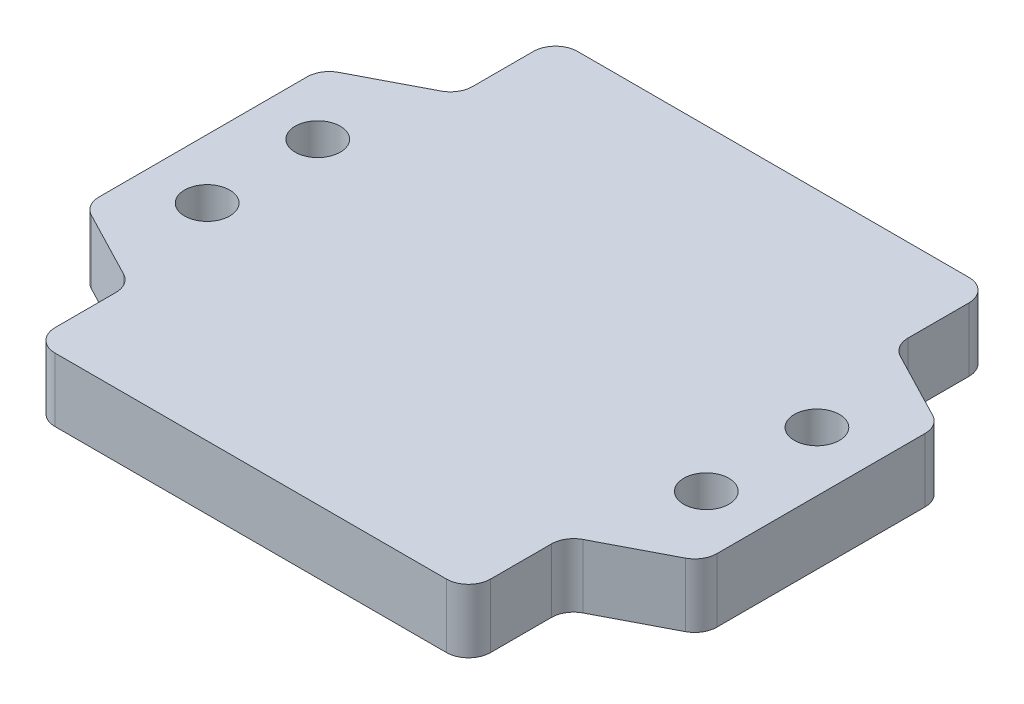
ISO-10303-21;
HEADER;
FILE_DESCRIPTION(('STEP AP214'),'2;1');
FILE_NAME('part.step','',(''),(''),'','','');
FILE_SCHEMA(('AUTOMOTIVE_DESIGN { 1 0 10303 214 1 1 1 1 }'));
ENDSEC;
DATA;
#1=APPLICATION_CONTEXT('core data for automotive mechanical design processes');
#2=APPLICATION_PROTOCOL_DEFINITION('international standard','automotive_design',2000,#1);
#3=PRODUCT_CONTEXT('',#1,'mechanical');
#4=PRODUCT('Part','Part','',(#3));
#5=PRODUCT_RELATED_PRODUCT_CATEGORY('part','',(#4));
#6=PRODUCT_DEFINITION_FORMATION('','',#4);
#7=PRODUCT_DEFINITION_CONTEXT('part definition',#1,'design');
#8=PRODUCT_DEFINITION('design','',#6,#7);
#9=PRODUCT_DEFINITION_SHAPE('','',#8);
#10=(LENGTH_UNIT() NAMED_UNIT(*) SI_UNIT(.MILLI.,.METRE.));
#11=(NAMED_UNIT(*) PLANE_ANGLE_UNIT() SI_UNIT($,.RADIAN.));
#12=(NAMED_UNIT(*) SI_UNIT($,.STERADIAN.) SOLID_ANGLE_UNIT());
#13=UNCERTAINTY_MEASURE_WITH_UNIT(LENGTH_MEASURE(1.E-05),#10,'distance_accuracy_value','');
#14=(GEOMETRIC_REPRESENTATION_CONTEXT(3) GLOBAL_UNCERTAINTY_ASSIGNED_CONTEXT((#13)) GLOBAL_UNIT_ASSIGNED_CONTEXT((#10,
#11,#12)) REPRESENTATION_CONTEXT('',''));
#15=CARTESIAN_POINT('',(0.,0.,0.));
#16=DIRECTION('',(0.,0.,1.));
#17=DIRECTION('',(1.,0.,0.));
#18=AXIS2_PLACEMENT_3D('',#15,#16,#17);
#19=CARTESIAN_POINT('',(0.,7.3152,0.));
#20=DIRECTION('',(0.,1.,0.));
#21=DIRECTION('',(0.,0.,1.));
#22=AXIS2_PLACEMENT_3D('',#19,#20,#21);
#23=PLANE('',#22);
#24=DIRECTION('',(0.,0.,1.));
#25=VECTOR('',#24,1.);
#26=CARTESIAN_POINT('',(-35.472859966,7.3152,30.));
#27=LINE('',#26,#25);
#28=CARTESIAN_POINT('',(-35.472859966,7.3152,-11.9477623690497));
#29=VERTEX_POINT('',#28);
#30=CARTESIAN_POINT('',(-35.472859966,7.3152,11.9477623690497));
#31=VERTEX_POINT('',#30);
#32=EDGE_CURVE('E262',#29,#31,#27,.T.);
#33=ORIENTED_EDGE('',*,*,#32,.T.);
#34=CARTESIAN_POINT('',(-32.932859966,7.3152,11.9477623690497));
#35=DIRECTION('',(0.,1.,0.));
#36=DIRECTION('',(0.,0.,1.));
#37=AXIS2_PLACEMENT_3D('',#34,#35,#36);
#38=CIRCLE('',#37,2.54);
#39=CARTESIAN_POINT('',(-34.1044985055158,7.3152,14.2013956872098));
#40=VERTEX_POINT('',#39);
#41=EDGE_CURVE('E323',#31,#40,#38,.T.);
#42=ORIENTED_EDGE('',*,*,#41,.T.);
#43=DIRECTION('',(0.887257211874052,0.,0.461275015557403));
#44=VECTOR('',#43,1.);
#45=CARTESIAN_POINT('',(-35.472859966,7.3152,13.49));
#46=LINE('',#45,#44);
#47=CARTESIAN_POINT('',(-26.3756204872549,7.3152,18.2195521816319));
#48=VERTEX_POINT('',#47);
#49=EDGE_CURVE('E403',#40,#48,#46,.T.);
#50=ORIENTED_EDGE('',*,*,#49,.T.);
#51=CARTESIAN_POINT('',(-27.5472590267708,7.3152,20.473185499792));
#52=DIRECTION('',(0.,1.,0.));
#53=DIRECTION('',(0.,0.,1.));
#54=AXIS2_PLACEMENT_3D('',#51,#52,#53);
#55=CIRCLE('',#54,2.54);
#56=CARTESIAN_POINT('',(-25.0072590267708,7.3152,20.473185499792));
#57=VERTEX_POINT('',#56);
#58=EDGE_CURVE('E367',#48,#57,#55,.F.);
#59=ORIENTED_EDGE('',*,*,#58,.T.);
#60=DIRECTION('',(0.,0.,1.));
#61=VECTOR('',#60,1.);
#62=CARTESIAN_POINT('',(-25.0072590267708,7.3152,18.9309478688417));
#63=LINE('',#62,#61);
#64=CARTESIAN_POINT('',(-25.0072590267708,7.3152,27.46));
#65=VERTEX_POINT('',#64);
#66=EDGE_CURVE('E400',#57,#65,#63,.T.);
#67=ORIENTED_EDGE('',*,*,#66,.T.);
#68=CARTESIAN_POINT('',(-22.4672590267708,7.3152,27.46));
#69=DIRECTION('',(0.,1.,0.));
#70=DIRECTION('',(0.,0.,1.));
#71=AXIS2_PLACEMENT_3D('',#68,#69,#70);
#72=CIRCLE('',#71,2.54);
#73=CARTESIAN_POINT('',(-22.4672590267707,7.3152,30.));
#74=VERTEX_POINT('',#73);
#75=EDGE_CURVE('E321',#65,#74,#72,.T.);
#76=ORIENTED_EDGE('',*,*,#75,.T.);
#77=DIRECTION('',(1.,0.,0.));
#78=VECTOR('',#77,1.);
#79=CARTESIAN_POINT('',(35.472859966,7.3152,30.));
#80=LINE('',#79,#78);
#81=CARTESIAN_POINT('',(22.4672590267708,7.3152,30.));
#82=VERTEX_POINT('',#81);
#83=EDGE_CURVE('E264',#74,#82,#80,.T.);
#84=ORIENTED_EDGE('',*,*,#83,.T.);
#85=CARTESIAN_POINT('',(22.4672590267708,7.3152,27.46));
#86=DIRECTION('',(0.,1.,0.));
#87=DIRECTION('',(0.,0.,1.));
#88=AXIS2_PLACEMENT_3D('',#85,#86,#87);
#89=CIRCLE('',#88,2.54);
#90=CARTESIAN_POINT('',(25.0072590267708,7.3152,27.46));
#91=VERTEX_POINT('',#90);
#92=EDGE_CURVE('E319',#82,#91,#89,.T.);
#93=ORIENTED_EDGE('',*,*,#92,.T.);
#94=DIRECTION('',(0.,0.,1.));
#95=VECTOR('',#94,1.);
#96=CARTESIAN_POINT('',(25.0072590267708,7.3152,18.9309478688417));
#97=LINE('',#96,#95);
#98=CARTESIAN_POINT('',(25.0072590267708,7.3152,20.473185499792));
#99=VERTEX_POINT('',#98);
#100=EDGE_CURVE('E728',#99,#91,#97,.T.);
#101=ORIENTED_EDGE('',*,*,#100,.F.);
#102=CARTESIAN_POINT('',(27.5472590267708,7.3152,20.473185499792));
#103=DIRECTION('',(0.,1.,0.));
#104=DIRECTION('',(0.,0.,1.));
#105=AXIS2_PLACEMENT_3D('',#102,#103,#104);
#106=CIRCLE('',#105,2.54);
#107=CARTESIAN_POINT('',(26.3756204872549,7.3152,18.2195521816319));
#108=VERTEX_POINT('',#107);
#109=EDGE_CURVE('E371',#99,#108,#106,.F.);
#110=ORIENTED_EDGE('',*,*,#109,.T.);
#111=DIRECTION('',(-0.887257211874052,0.,0.461275015557403));
#112=VECTOR('',#111,1.);
#113=CARTESIAN_POINT('',(35.472859966,7.3152,13.49));
#114=LINE('',#113,#112);
#115=CARTESIAN_POINT('',(34.1044985055158,7.3152,14.2013956872098));
#116=VERTEX_POINT('',#115);
#117=EDGE_CURVE('E720',#116,#108,#114,.T.);
#118=ORIENTED_EDGE('',*,*,#117,.F.);
#119=CARTESIAN_POINT('',(32.932859966,7.3152,11.9477623690497));
#120=DIRECTION('',(0.,1.,0.));
#121=DIRECTION('',(0.,0.,1.));
#122=AXIS2_PLACEMENT_3D('',#119,#120,#121);
#123=CIRCLE('',#122,2.54);
#124=CARTESIAN_POINT('',(35.472859966,7.3152,11.9477623690497));
#125=VERTEX_POINT('',#124);
#126=EDGE_CURVE('E317',#116,#125,#123,.T.);
#127=ORIENTED_EDGE('',*,*,#126,.T.);
#128=DIRECTION('',(0.,0.,-1.));
#129=VECTOR('',#128,1.);
#130=CARTESIAN_POINT('',(35.472859966,7.3152,30.));
#131=LINE('',#130,#129);
#132=CARTESIAN_POINT('',(35.472859966,7.3152,-11.9477623690497));
#133=VERTEX_POINT('',#132);
#134=EDGE_CURVE('E268',#125,#133,#131,.T.);
#135=ORIENTED_EDGE('',*,*,#134,.T.);
#136=CARTESIAN_POINT('',(32.932859966,7.3152,-11.9477623690497));
#137=DIRECTION('',(0.,1.,0.));
#138=DIRECTION('',(0.,0.,1.));
#139=AXIS2_PLACEMENT_3D('',#136,#137,#138);
#140=CIRCLE('',#139,2.54);
#141=CARTESIAN_POINT('',(34.1044985055158,7.3152,-14.2013956872098));
#142=VERTEX_POINT('',#141);
#143=EDGE_CURVE('E315',#133,#142,#140,.T.);
#144=ORIENTED_EDGE('',*,*,#143,.T.);
#145=DIRECTION('',(-0.887257211874052,0.,-0.461275015557403));
#146=VECTOR('',#145,1.);
#147=CARTESIAN_POINT('',(35.472859966,7.3152,-13.49));
#148=LINE('',#147,#146);
#149=CARTESIAN_POINT('',(26.3756204872549,7.3152,-18.2195521816319));
#150=VERTEX_POINT('',#149);
#151=EDGE_CURVE('E379',#142,#150,#148,.T.);
#152=ORIENTED_EDGE('',*,*,#151,.T.);
#153=CARTESIAN_POINT('',(27.5472590267708,7.3152,-20.473185499792));
#154=DIRECTION('',(0.,1.,0.));
#155=DIRECTION('',(0.,0.,1.));
#156=AXIS2_PLACEMENT_3D('',#153,#154,#155);
#157=CIRCLE('',#156,2.54);
#158=CARTESIAN_POINT('',(25.0072590267708,7.3152,-20.473185499792));
#159=VERTEX_POINT('',#158);
#160=EDGE_CURVE('E46',#150,#159,#157,.F.);
#161=ORIENTED_EDGE('',*,*,#160,.T.);
#162=DIRECTION('',(0.,0.,-1.));
#163=VECTOR('',#162,1.);
#164=CARTESIAN_POINT('',(25.0072590267708,7.3152,-18.9309478688417));
#165=LINE('',#164,#163);
#166=CARTESIAN_POINT('',(25.0072590267708,7.3152,-27.46));
#167=VERTEX_POINT('',#166);
#168=EDGE_CURVE('E377',#159,#167,#165,.T.);
#169=ORIENTED_EDGE('',*,*,#168,.T.);
#170=CARTESIAN_POINT('',(22.4672590267708,7.3152,-27.46));
#171=DIRECTION('',(0.,1.,0.));
#172=DIRECTION('',(0.,0.,1.));
#173=AXIS2_PLACEMENT_3D('',#170,#171,#172);
#174=CIRCLE('',#173,2.54);
#175=CARTESIAN_POINT('',(22.4672590267708,7.3152,-30.));
#176=VERTEX_POINT('',#175);
#177=EDGE_CURVE('E313',#167,#176,#174,.T.);
#178=ORIENTED_EDGE('',*,*,#177,.T.);
#179=DIRECTION('',(-1.,0.,0.));
#180=VECTOR('',#179,1.);
#181=CARTESIAN_POINT('',(35.472859966,7.3152,-30.));
#182=LINE('',#181,#180);
#183=CARTESIAN_POINT('',(-22.4672590267707,7.3152,-30.));
#184=VERTEX_POINT('',#183);
#185=EDGE_CURVE('E271',#176,#184,#182,.T.);
#186=ORIENTED_EDGE('',*,*,#185,.T.);
#187=CARTESIAN_POINT('',(-22.4672590267708,7.3152,-27.46));
#188=DIRECTION('',(0.,1.,0.));
#189=DIRECTION('',(0.,0.,1.));
#190=AXIS2_PLACEMENT_3D('',#187,#188,#189);
#191=CIRCLE('',#190,2.54);
#192=CARTESIAN_POINT('',(-25.0072590267708,7.3152,-27.46));
#193=VERTEX_POINT('',#192);
#194=EDGE_CURVE('E210',#184,#193,#191,.T.);
#195=ORIENTED_EDGE('',*,*,#194,.T.);
#196=DIRECTION('',(0.,0.,-1.));
#197=VECTOR('',#196,1.);
#198=CARTESIAN_POINT('',(-25.0072590267708,7.3152,-18.9309478688417));
#199=LINE('',#198,#197);
#200=CARTESIAN_POINT('',(-25.0072590267708,7.3152,-20.473185499792));
#201=VERTEX_POINT('',#200);
#202=EDGE_CURVE('E225',#201,#193,#199,.T.);
#203=ORIENTED_EDGE('',*,*,#202,.F.);
#204=CARTESIAN_POINT('',(-27.5472590267708,7.3152,-20.473185499792));
#205=DIRECTION('',(0.,1.,0.));
#206=DIRECTION('',(0.,0.,1.));
#207=AXIS2_PLACEMENT_3D('',#204,#205,#206);
#208=CIRCLE('',#207,2.54);
#209=CARTESIAN_POINT('',(-26.3756204872549,7.3152,-18.2195521816319));
#210=VERTEX_POINT('',#209);
#211=EDGE_CURVE('E224',#201,#210,#208,.F.);
#212=ORIENTED_EDGE('',*,*,#211,.T.);
#213=DIRECTION('',(0.887257211874052,0.,-0.461275015557403));
#214=VECTOR('',#213,1.);
#215=CARTESIAN_POINT('',(-35.472859966,7.3152,-13.49));
#216=LINE('',#215,#214);
#217=CARTESIAN_POINT('',(-34.1044985055158,7.3152,-14.2013956872098));
#218=VERTEX_POINT('',#217);
#219=EDGE_CURVE('E216',#218,#210,#216,.T.);
#220=ORIENTED_EDGE('',*,*,#219,.F.);
#221=CARTESIAN_POINT('',(-32.932859966,7.3152,-11.9477623690497));
#222=DIRECTION('',(0.,1.,0.));
#223=DIRECTION('',(0.,0.,1.));
#224=AXIS2_PLACEMENT_3D('',#221,#222,#223);
#225=CIRCLE('',#224,2.54);
#226=EDGE_CURVE('E200',#218,#29,#225,.T.);
#227=ORIENTED_EDGE('',*,*,#226,.T.);
#228=EDGE_LOOP('',(#33,#42,#50,#59,#67,#76,#84,#93,#101,#110,#118,#127,#135,#144,#152,#161,#169,
#178,#186,#195,#203,#212,#220,#227));
#229=FACE_BOUND('',#228,.T.);
#230=CARTESIAN_POINT('',(28.662459966,7.3152,6.34740000000001));
#231=DIRECTION('',(0.,1.,0.));
#232=DIRECTION('',(0.,0.,1.));
#233=AXIS2_PLACEMENT_3D('',#230,#231,#232);
#234=CIRCLE('',#233,2.59079999999998);
#235=CARTESIAN_POINT('',(28.662459966,7.3152,8.93819999999999));
#236=VERTEX_POINT('',#235);
#237=EDGE_CURVE('E237',#236,#236,#234,.T.);
#238=ORIENTED_EDGE('',*,*,#237,.F.);
#239=EDGE_LOOP('',(#238));
#240=FACE_BOUND('',#239,.T.);
#241=CARTESIAN_POINT('',(28.662459966,7.3152,-6.35259999999999));
#242=DIRECTION('',(0.,1.,0.));
#243=DIRECTION('',(0.,0.,1.));
#244=AXIS2_PLACEMENT_3D('',#241,#242,#243);
#245=CIRCLE('',#244,2.59079999999998);
#246=CARTESIAN_POINT('',(28.662459966,7.3152,-3.76180000000001));
#247=VERTEX_POINT('',#246);
#248=EDGE_CURVE('E243',#247,#247,#245,.T.);
#249=ORIENTED_EDGE('',*,*,#248,.F.);
#250=EDGE_LOOP('',(#249));
#251=FACE_BOUND('',#250,.T.);
#252=CARTESIAN_POINT('',(-28.662459966,7.3152,6.34740000000001));
#253=DIRECTION('',(0.,1.,0.));
#254=DIRECTION('',(0.,0.,1.));
#255=AXIS2_PLACEMENT_3D('',#252,#253,#254);
#256=CIRCLE('',#255,2.59079999999999);
#257=CARTESIAN_POINT('',(-28.662459966,7.3152,8.93819999999999));
#258=VERTEX_POINT('',#257);
#259=EDGE_CURVE('E249',#258,#258,#256,.T.);
#260=ORIENTED_EDGE('',*,*,#259,.F.);
#261=EDGE_LOOP('',(#260));
#262=FACE_BOUND('',#261,.T.);
#263=CARTESIAN_POINT('',(-28.662459966,7.3152,-6.35259999999999));
#264=DIRECTION('',(0.,1.,0.));
#265=DIRECTION('',(0.,0.,1.));
#266=AXIS2_PLACEMENT_3D('',#263,#264,#265);
#267=CIRCLE('',#266,2.59079999999999);
#268=CARTESIAN_POINT('',(-28.662459966,7.3152,-3.76180000000001));
#269=VERTEX_POINT('',#268);
#270=EDGE_CURVE('E255',#269,#269,#267,.T.);
#271=ORIENTED_EDGE('',*,*,#270,.F.);
#272=EDGE_LOOP('',(#271));
#273=FACE_BOUND('',#272,.T.);
#274=ADVANCED_FACE('F38',(#229,#240,#251,#262,#273),#23,.T.);
#275=CARTESIAN_POINT('',(0.,0.,0.));
#276=DIRECTION('',(0.,1.,0.));
#277=DIRECTION('',(0.,0.,1.));
#278=AXIS2_PLACEMENT_3D('',#275,#276,#277);
#279=PLANE('',#278);
#280=CARTESIAN_POINT('',(28.662459966,0.,6.34740000000001));
#281=DIRECTION('',(0.,1.,0.));
#282=DIRECTION('',(0.,0.,1.));
#283=AXIS2_PLACEMENT_3D('',#280,#281,#282);
#284=CIRCLE('',#283,2.5908);
#285=CARTESIAN_POINT('',(28.662459966,0.,8.9382));
#286=VERTEX_POINT('',#285);
#287=EDGE_CURVE('E240',#286,#286,#284,.T.);
#288=ORIENTED_EDGE('',*,*,#287,.T.);
#289=EDGE_LOOP('',(#288));
#290=FACE_BOUND('',#289,.T.);
#291=CARTESIAN_POINT('',(28.662459966,0.,-6.35259999999999));
#292=DIRECTION('',(0.,1.,0.));
#293=DIRECTION('',(0.,0.,1.));
#294=AXIS2_PLACEMENT_3D('',#291,#292,#293);
#295=CIRCLE('',#294,2.5908);
#296=CARTESIAN_POINT('',(28.662459966,0.,-3.7618));
#297=VERTEX_POINT('',#296);
#298=EDGE_CURVE('E246',#297,#297,#295,.T.);
#299=ORIENTED_EDGE('',*,*,#298,.T.);
#300=EDGE_LOOP('',(#299));
#301=FACE_BOUND('',#300,.T.);
#302=CARTESIAN_POINT('',(-28.662459966,0.,6.34740000000001));
#303=DIRECTION('',(0.,1.,0.));
#304=DIRECTION('',(0.,0.,1.));
#305=AXIS2_PLACEMENT_3D('',#302,#303,#304);
#306=CIRCLE('',#305,2.5908);
#307=CARTESIAN_POINT('',(-28.662459966,0.,8.9382));
#308=VERTEX_POINT('',#307);
#309=EDGE_CURVE('E252',#308,#308,#306,.T.);
#310=ORIENTED_EDGE('',*,*,#309,.T.);
#311=EDGE_LOOP('',(#310));
#312=FACE_BOUND('',#311,.T.);
#313=CARTESIAN_POINT('',(-28.662459966,0.,-6.35259999999999));
#314=DIRECTION('',(0.,1.,0.));
#315=DIRECTION('',(0.,0.,1.));
#316=AXIS2_PLACEMENT_3D('',#313,#314,#315);
#317=CIRCLE('',#316,2.5908);
#318=CARTESIAN_POINT('',(-28.662459966,0.,-3.7618));
#319=VERTEX_POINT('',#318);
#320=EDGE_CURVE('E258',#319,#319,#317,.T.);
#321=ORIENTED_EDGE('',*,*,#320,.T.);
#322=EDGE_LOOP('',(#321));
#323=FACE_BOUND('',#322,.T.);
#324=DIRECTION('',(0.887257211874052,0.,0.461275015557403));
#325=VECTOR('',#324,1.);
#326=CARTESIAN_POINT('',(-35.472859966,0.,13.49));
#327=LINE('',#326,#325);
#328=CARTESIAN_POINT('',(-34.1044985055158,0.,14.2013956872098));
#329=VERTEX_POINT('',#328);
#330=CARTESIAN_POINT('',(-26.3756204872549,0.,18.2195521816319));
#331=VERTEX_POINT('',#330);
#332=EDGE_CURVE('E226',#329,#331,#327,.T.);
#333=ORIENTED_EDGE('',*,*,#332,.F.);
#334=CARTESIAN_POINT('',(-32.932859966,0.,11.9477623690497));
#335=DIRECTION('',(0.,1.,0.));
#336=DIRECTION('',(0.,0.,1.));
#337=AXIS2_PLACEMENT_3D('',#334,#335,#336);
#338=CIRCLE('',#337,2.54);
#339=CARTESIAN_POINT('',(-35.472859966,0.,11.9477623690497));
#340=VERTEX_POINT('',#339);
#341=EDGE_CURVE('E334',#329,#340,#338,.F.);
#342=ORIENTED_EDGE('',*,*,#341,.T.);
#343=DIRECTION('',(0.,0.,1.));
#344=VECTOR('',#343,1.);
#345=CARTESIAN_POINT('',(-35.472859966,0.,30.));
#346=LINE('',#345,#344);
#347=CARTESIAN_POINT('',(-35.472859966,0.,-11.9477623690497));
#348=VERTEX_POINT('',#347);
#349=EDGE_CURVE('E261',#348,#340,#346,.T.);
#350=ORIENTED_EDGE('',*,*,#349,.F.);
#351=CARTESIAN_POINT('',(-32.932859966,0.,-11.9477623690497));
#352=DIRECTION('',(0.,1.,0.));
#353=DIRECTION('',(0.,0.,1.));
#354=AXIS2_PLACEMENT_3D('',#351,#352,#353);
#355=CIRCLE('',#354,2.54);
#356=CARTESIAN_POINT('',(-34.1044985055158,0.,-14.2013956872098));
#357=VERTEX_POINT('',#356);
#358=EDGE_CURVE('E287',#348,#357,#355,.F.);
#359=ORIENTED_EDGE('',*,*,#358,.T.);
#360=DIRECTION('',(0.887257211874052,0.,-0.461275015557403));
#361=VECTOR('',#360,1.);
#362=CARTESIAN_POINT('',(-35.472859966,0.,-13.49));
#363=LINE('',#362,#361);
#364=CARTESIAN_POINT('',(-26.3756204872549,0.,-18.2195521816319));
#365=VERTEX_POINT('',#364);
#366=EDGE_CURVE('E219',#357,#365,#363,.T.);
#367=ORIENTED_EDGE('',*,*,#366,.T.);
#368=CARTESIAN_POINT('',(-27.5472590267708,0.,-20.473185499792));
#369=DIRECTION('',(0.,1.,0.));
#370=DIRECTION('',(0.,0.,1.));
#371=AXIS2_PLACEMENT_3D('',#368,#369,#370);
#372=CIRCLE('',#371,2.54);
#373=CARTESIAN_POINT('',(-25.0072590267708,0.,-20.473185499792));
#374=VERTEX_POINT('',#373);
#375=EDGE_CURVE('E298',#365,#374,#372,.T.);
#376=ORIENTED_EDGE('',*,*,#375,.T.);
#377=DIRECTION('',(0.,0.,-1.));
#378=VECTOR('',#377,1.);
#379=CARTESIAN_POINT('',(-25.0072590267708,0.,-18.9309478688417));
#380=LINE('',#379,#378);
#381=CARTESIAN_POINT('',(-25.0072590267708,0.,-27.46));
#382=VERTEX_POINT('',#381);
#383=EDGE_CURVE('E234',#374,#382,#380,.T.);
#384=ORIENTED_EDGE('',*,*,#383,.T.);
#385=CARTESIAN_POINT('',(-22.4672590267708,0.,-27.46));
#386=DIRECTION('',(0.,1.,0.));
#387=DIRECTION('',(0.,0.,1.));
#388=AXIS2_PLACEMENT_3D('',#385,#386,#387);
#389=CIRCLE('',#388,2.54);
#390=CARTESIAN_POINT('',(-22.4672590267707,0.,-30.));
#391=VERTEX_POINT('',#390);
#392=EDGE_CURVE('E284',#382,#391,#389,.F.);
#393=ORIENTED_EDGE('',*,*,#392,.T.);
#394=DIRECTION('',(-1.,0.,0.));
#395=VECTOR('',#394,1.);
#396=CARTESIAN_POINT('',(35.472859966,0.,-30.));
#397=LINE('',#396,#395);
#398=CARTESIAN_POINT('',(22.4672590267708,0.,-30.));
#399=VERTEX_POINT('',#398);
#400=EDGE_CURVE('E265',#399,#391,#397,.T.);
#401=ORIENTED_EDGE('',*,*,#400,.F.);
#402=CARTESIAN_POINT('',(22.4672590267708,0.,-27.46));
#403=DIRECTION('',(0.,1.,0.));
#404=DIRECTION('',(0.,0.,1.));
#405=AXIS2_PLACEMENT_3D('',#402,#403,#404);
#406=CIRCLE('',#405,2.54);
#407=CARTESIAN_POINT('',(25.0072590267708,0.,-27.46));
#408=VERTEX_POINT('',#407);
#409=EDGE_CURVE('E325',#399,#408,#406,.F.);
#410=ORIENTED_EDGE('',*,*,#409,.T.);
#411=DIRECTION('',(0.,0.,-1.));
#412=VECTOR('',#411,1.);
#413=CARTESIAN_POINT('',(25.0072590267708,0.,-18.9309478688417));
#414=LINE('',#413,#412);
#415=CARTESIAN_POINT('',(25.0072590267708,0.,-20.473185499792));
#416=VERTEX_POINT('',#415);
#417=EDGE_CURVE('E396',#416,#408,#414,.T.);
#418=ORIENTED_EDGE('',*,*,#417,.F.);
#419=CARTESIAN_POINT('',(27.5472590267708,0.,-20.473185499792));
#420=DIRECTION('',(0.,1.,0.));
#421=DIRECTION('',(0.,0.,1.));
#422=AXIS2_PLACEMENT_3D('',#419,#420,#421);
#423=CIRCLE('',#422,2.54);
#424=CARTESIAN_POINT('',(26.3756204872549,0.,-18.2195521816319));
#425=VERTEX_POINT('',#424);
#426=EDGE_CURVE('E11',#416,#425,#423,.T.);
#427=ORIENTED_EDGE('',*,*,#426,.T.);
#428=DIRECTION('',(-0.887257211874052,0.,-0.461275015557403));
#429=VECTOR('',#428,1.);
#430=CARTESIAN_POINT('',(35.472859966,0.,-13.49));
#431=LINE('',#430,#429);
#432=CARTESIAN_POINT('',(34.1044985055158,0.,-14.2013956872098));
#433=VERTEX_POINT('',#432);
#434=EDGE_CURVE('E395',#433,#425,#431,.T.);
#435=ORIENTED_EDGE('',*,*,#434,.F.);
#436=CARTESIAN_POINT('',(32.932859966,0.,-11.9477623690497));
#437=DIRECTION('',(0.,1.,0.));
#438=DIRECTION('',(0.,0.,1.));
#439=AXIS2_PLACEMENT_3D('',#436,#437,#438);
#440=CIRCLE('',#439,2.54);
#441=CARTESIAN_POINT('',(35.472859966,0.,-11.9477623690497));
#442=VERTEX_POINT('',#441);
#443=EDGE_CURVE('E53',#433,#442,#440,.F.);
#444=ORIENTED_EDGE('',*,*,#443,.T.);
#445=DIRECTION('',(0.,0.,-1.));
#446=VECTOR('',#445,1.);
#447=CARTESIAN_POINT('',(35.472859966,0.,30.));
#448=LINE('',#447,#446);
#449=CARTESIAN_POINT('',(35.472859966,0.,11.9477623690497));
#450=VERTEX_POINT('',#449);
#451=EDGE_CURVE('E278',#450,#442,#448,.T.);
#452=ORIENTED_EDGE('',*,*,#451,.F.);
#453=CARTESIAN_POINT('',(32.932859966,0.,11.9477623690497));
#454=DIRECTION('',(0.,1.,0.));
#455=DIRECTION('',(0.,0.,1.));
#456=AXIS2_PLACEMENT_3D('',#453,#454,#455);
#457=CIRCLE('',#456,2.54);
#458=CARTESIAN_POINT('',(34.1044985055158,0.,14.2013956872098));
#459=VERTEX_POINT('',#458);
#460=EDGE_CURVE('E328',#450,#459,#457,.F.);
#461=ORIENTED_EDGE('',*,*,#460,.T.);
#462=DIRECTION('',(-0.887257211874052,0.,0.461275015557403));
#463=VECTOR('',#462,1.);
#464=CARTESIAN_POINT('',(35.472859966,0.,13.49));
#465=LINE('',#464,#463);
#466=CARTESIAN_POINT('',(26.3756204872549,0.,18.2195521816319));
#467=VERTEX_POINT('',#466);
#468=EDGE_CURVE('E726',#459,#467,#465,.T.);
#469=ORIENTED_EDGE('',*,*,#468,.T.);
#470=CARTESIAN_POINT('',(27.5472590267708,0.,20.473185499792));
#471=DIRECTION('',(0.,1.,0.));
#472=DIRECTION('',(0.,0.,1.));
#473=AXIS2_PLACEMENT_3D('',#470,#471,#472);
#474=CIRCLE('',#473,2.54);
#475=CARTESIAN_POINT('',(25.0072590267708,0.,20.473185499792));
#476=VERTEX_POINT('',#475);
#477=EDGE_CURVE('E373',#467,#476,#474,.T.);
#478=ORIENTED_EDGE('',*,*,#477,.T.);
#479=DIRECTION('',(0.,0.,1.));
#480=VECTOR('',#479,1.);
#481=CARTESIAN_POINT('',(25.0072590267708,0.,18.9309478688417));
#482=LINE('',#481,#480);
#483=CARTESIAN_POINT('',(25.0072590267708,0.,27.46));
#484=VERTEX_POINT('',#483);
#485=EDGE_CURVE('E388',#476,#484,#482,.T.);
#486=ORIENTED_EDGE('',*,*,#485,.T.);
#487=CARTESIAN_POINT('',(22.4672590267708,0.,27.46));
#488=DIRECTION('',(0.,1.,0.));
#489=DIRECTION('',(0.,0.,1.));
#490=AXIS2_PLACEMENT_3D('',#487,#488,#489);
#491=CIRCLE('',#490,2.54);
#492=CARTESIAN_POINT('',(22.4672590267708,0.,30.));
#493=VERTEX_POINT('',#492);
#494=EDGE_CURVE('E330',#484,#493,#491,.F.);
#495=ORIENTED_EDGE('',*,*,#494,.T.);
#496=DIRECTION('',(1.,0.,0.));
#497=VECTOR('',#496,1.);
#498=CARTESIAN_POINT('',(35.472859966,0.,30.));
#499=LINE('',#498,#497);
#500=CARTESIAN_POINT('',(-22.4672590267707,0.,30.));
#501=VERTEX_POINT('',#500);
#502=EDGE_CURVE('E275',#501,#493,#499,.T.);
#503=ORIENTED_EDGE('',*,*,#502,.F.);
#504=CARTESIAN_POINT('',(-22.4672590267708,0.,27.46));
#505=DIRECTION('',(0.,1.,0.));
#506=DIRECTION('',(0.,0.,1.));
#507=AXIS2_PLACEMENT_3D('',#504,#505,#506);
#508=CIRCLE('',#507,2.54);
#509=CARTESIAN_POINT('',(-25.0072590267708,0.,27.46));
#510=VERTEX_POINT('',#509);
#511=EDGE_CURVE('E332',#501,#510,#508,.F.);
#512=ORIENTED_EDGE('',*,*,#511,.T.);
#513=DIRECTION('',(0.,0.,1.));
#514=VECTOR('',#513,1.);
#515=CARTESIAN_POINT('',(-25.0072590267708,0.,18.9309478688417));
#516=LINE('',#515,#514);
#517=CARTESIAN_POINT('',(-25.0072590267708,0.,20.473185499792));
#518=VERTEX_POINT('',#517);
#519=EDGE_CURVE('E231',#518,#510,#516,.T.);
#520=ORIENTED_EDGE('',*,*,#519,.F.);
#521=CARTESIAN_POINT('',(-27.5472590267708,0.,20.473185499792));
#522=DIRECTION('',(0.,1.,0.));
#523=DIRECTION('',(0.,0.,1.));
#524=AXIS2_PLACEMENT_3D('',#521,#522,#523);
#525=CIRCLE('',#524,2.54);
#526=EDGE_CURVE('E369',#518,#331,#525,.T.);
#527=ORIENTED_EDGE('',*,*,#526,.T.);
#528=EDGE_LOOP('',(#333,#342,#350,#359,#367,#376,#384,#393,#401,#410,#418,#427,#435,#444,#452,
#461,#469,#478,#486,#495,#503,#512,#520,#527));
#529=FACE_BOUND('',#528,.T.);
#530=ADVANCED_FACE('F394',(#290,#301,#312,#323,#529),#279,.F.);
#531=CARTESIAN_POINT('',(35.472859966,7.3152,30.));
#532=DIRECTION('',(-1.,0.,0.));
#533=DIRECTION('',(0.,0.,1.));
#534=AXIS2_PLACEMENT_3D('',#531,#532,#533);
#535=PLANE('',#534);
#536=ORIENTED_EDGE('',*,*,#134,.F.);
#537=DIRECTION('',(0.,1.,0.));
#538=VECTOR('',#537,1.);
#539=CARTESIAN_POINT('',(35.472859966,7.3152,11.9477623690497));
#540=LINE('',#539,#538);
#541=EDGE_CURVE('E60',#125,#450,#540,.F.);
#542=ORIENTED_EDGE('',*,*,#541,.T.);
#543=ORIENTED_EDGE('',*,*,#451,.T.);
#544=DIRECTION('',(0.,1.,0.));
#545=VECTOR('',#544,1.);
#546=CARTESIAN_POINT('',(35.472859966,7.3152,-11.9477623690497));
#547=LINE('',#546,#545);
#548=EDGE_CURVE('E351',#442,#133,#547,.T.);
#549=ORIENTED_EDGE('',*,*,#548,.T.);
#550=EDGE_LOOP('',(#536,#542,#543,#549));
#551=FACE_BOUND('',#550,.T.);
#552=ADVANCED_FACE('F450',(#551),#535,.F.);
#553=CARTESIAN_POINT('',(35.472859966,7.3152,-30.));
#554=DIRECTION('',(0.,0.,1.));
#555=DIRECTION('',(1.,0.,0.));
#556=AXIS2_PLACEMENT_3D('',#553,#554,#555);
#557=PLANE('',#556);
#558=ORIENTED_EDGE('',*,*,#185,.F.);
#559=DIRECTION('',(0.,1.,0.));
#560=VECTOR('',#559,1.);
#561=CARTESIAN_POINT('',(22.4672590267708,0.,-30.));
#562=LINE('',#561,#560);
#563=EDGE_CURVE('E365',#176,#399,#562,.F.);
#564=ORIENTED_EDGE('',*,*,#563,.T.);
#565=ORIENTED_EDGE('',*,*,#400,.T.);
#566=DIRECTION('',(0.,1.,0.));
#567=VECTOR('',#566,1.);
#568=CARTESIAN_POINT('',(-22.4672590267708,7.3152,-30.));
#569=LINE('',#568,#567);
#570=EDGE_CURVE('E289',#391,#184,#569,.T.);
#571=ORIENTED_EDGE('',*,*,#570,.T.);
#572=EDGE_LOOP('',(#558,#564,#565,#571));
#573=FACE_BOUND('',#572,.T.);
#574=ADVANCED_FACE('F426',(#573),#557,.F.);
#575=CARTESIAN_POINT('',(-35.472859966,7.3152,30.));
#576=DIRECTION('',(1.,0.,0.));
#577=DIRECTION('',(0.,0.,-1.));
#578=AXIS2_PLACEMENT_3D('',#575,#576,#577);
#579=PLANE('',#578);
#580=ORIENTED_EDGE('',*,*,#349,.T.);
#581=DIRECTION('',(0.,1.,0.));
#582=VECTOR('',#581,1.);
#583=CARTESIAN_POINT('',(-35.472859966,7.3152,11.9477623690497));
#584=LINE('',#583,#582);
#585=EDGE_CURVE('E310',#340,#31,#584,.T.);
#586=ORIENTED_EDGE('',*,*,#585,.T.);
#587=ORIENTED_EDGE('',*,*,#32,.F.);
#588=DIRECTION('',(0.,1.,0.));
#589=VECTOR('',#588,1.);
#590=CARTESIAN_POINT('',(-35.472859966,7.3152,-11.9477623690497));
#591=LINE('',#590,#589);
#592=EDGE_CURVE('E205',#29,#348,#591,.F.);
#593=ORIENTED_EDGE('',*,*,#592,.T.);
#594=EDGE_LOOP('',(#580,#586,#587,#593));
#595=FACE_BOUND('',#594,.T.);
#596=ADVANCED_FACE('F459',(#595),#579,.F.);
#597=CARTESIAN_POINT('',(35.472859966,7.3152,30.));
#598=DIRECTION('',(0.,0.,-1.));
#599=DIRECTION('',(-1.,0.,0.));
#600=AXIS2_PLACEMENT_3D('',#597,#598,#599);
#601=PLANE('',#600);
#602=ORIENTED_EDGE('',*,*,#83,.F.);
#603=DIRECTION('',(0.,1.,0.));
#604=VECTOR('',#603,1.);
#605=CARTESIAN_POINT('',(-22.4672590267708,0.,30.));
#606=LINE('',#605,#604);
#607=EDGE_CURVE('E339',#74,#501,#606,.F.);
#608=ORIENTED_EDGE('',*,*,#607,.T.);
#609=ORIENTED_EDGE('',*,*,#502,.T.);
#610=DIRECTION('',(0.,1.,0.));
#611=VECTOR('',#610,1.);
#612=CARTESIAN_POINT('',(22.4672590267708,7.3152,30.));
#613=LINE('',#612,#611);
#614=EDGE_CURVE('E336',#493,#82,#613,.T.);
#615=ORIENTED_EDGE('',*,*,#614,.T.);
#616=EDGE_LOOP('',(#602,#608,#609,#615));
#617=FACE_BOUND('',#616,.T.);
#618=ADVANCED_FACE('F462',(#617),#601,.F.);
#619=CARTESIAN_POINT('',(-28.662459966,7.3152,-6.35259999999999));
#620=DIRECTION('',(0.,1.,0.));
#621=DIRECTION('',(0.,0.,1.));
#622=AXIS2_PLACEMENT_3D('',#619,#620,#621);
#623=CYLINDRICAL_SURFACE('',#622,2.59079999999999);
#624=ORIENTED_EDGE('',*,*,#320,.F.);
#625=EDGE_LOOP('',(#624));
#626=FACE_BOUND('',#625,.T.);
#627=ORIENTED_EDGE('',*,*,#270,.T.);
#628=EDGE_LOOP('',(#627));
#629=FACE_BOUND('',#628,.T.);
#630=ADVANCED_FACE('F454',(#626,#629),#623,.F.);
#631=CARTESIAN_POINT('',(-28.662459966,7.3152,6.34740000000001));
#632=DIRECTION('',(0.,1.,0.));
#633=DIRECTION('',(0.,0.,1.));
#634=AXIS2_PLACEMENT_3D('',#631,#632,#633);
#635=CYLINDRICAL_SURFACE('',#634,2.59079999999999);
#636=ORIENTED_EDGE('',*,*,#309,.F.);
#637=EDGE_LOOP('',(#636));
#638=FACE_BOUND('',#637,.T.);
#639=ORIENTED_EDGE('',*,*,#259,.T.);
#640=EDGE_LOOP('',(#639));
#641=FACE_BOUND('',#640,.T.);
#642=ADVANCED_FACE('F486',(#638,#641),#635,.F.);
#643=CARTESIAN_POINT('',(28.662459966,7.3152,-6.35259999999999));
#644=DIRECTION('',(0.,1.,0.));
#645=DIRECTION('',(0.,0.,1.));
#646=AXIS2_PLACEMENT_3D('',#643,#644,#645);
#647=CYLINDRICAL_SURFACE('',#646,2.59079999999999);
#648=ORIENTED_EDGE('',*,*,#298,.F.);
#649=EDGE_LOOP('',(#648));
#650=FACE_BOUND('',#649,.T.);
#651=ORIENTED_EDGE('',*,*,#248,.T.);
#652=EDGE_LOOP('',(#651));
#653=FACE_BOUND('',#652,.T.);
#654=ADVANCED_FACE('F483',(#650,#653),#647,.F.);
#655=CARTESIAN_POINT('',(28.662459966,7.3152,6.34740000000001));
#656=DIRECTION('',(0.,1.,0.));
#657=DIRECTION('',(0.,0.,1.));
#658=AXIS2_PLACEMENT_3D('',#655,#656,#657);
#659=CYLINDRICAL_SURFACE('',#658,2.59079999999999);
#660=ORIENTED_EDGE('',*,*,#287,.F.);
#661=EDGE_LOOP('',(#660));
#662=FACE_BOUND('',#661,.T.);
#663=ORIENTED_EDGE('',*,*,#237,.T.);
#664=EDGE_LOOP('',(#663));
#665=FACE_BOUND('',#664,.T.);
#666=ADVANCED_FACE('F477',(#662,#665),#659,.F.);
#667=CARTESIAN_POINT('',(-25.0072590267708,0.,-18.9309478688417));
#668=DIRECTION('',(1.,0.,0.));
#669=DIRECTION('',(0.,0.,-1.));
#670=AXIS2_PLACEMENT_3D('',#667,#668,#669);
#671=PLANE('',#670);
#672=ORIENTED_EDGE('',*,*,#202,.T.);
#673=DIRECTION('',(0.,1.,0.));
#674=VECTOR('',#673,1.);
#675=CARTESIAN_POINT('',(-25.0072590267708,0.,-27.46));
#676=LINE('',#675,#674);
#677=EDGE_CURVE('E295',#193,#382,#676,.F.);
#678=ORIENTED_EDGE('',*,*,#677,.T.);
#679=ORIENTED_EDGE('',*,*,#383,.F.);
#680=DIRECTION('',(0.,1.,0.));
#681=VECTOR('',#680,1.);
#682=CARTESIAN_POINT('',(-25.0072590267708,7.3152,-20.473185499792));
#683=LINE('',#682,#681);
#684=EDGE_CURVE('E292',#374,#201,#683,.T.);
#685=ORIENTED_EDGE('',*,*,#684,.T.);
#686=EDGE_LOOP('',(#672,#678,#679,#685));
#687=FACE_BOUND('',#686,.T.);
#688=ADVANCED_FACE('F430',(#687),#671,.F.);
#689=CARTESIAN_POINT('',(-35.472859966,0.,-13.49));
#690=DIRECTION('',(0.461275015557403,0.,0.887257211874052));
#691=DIRECTION('',(0.887257211874052,0.,-0.461275015557403));
#692=AXIS2_PLACEMENT_3D('',#689,#690,#691);
#693=PLANE('',#692);
#694=ORIENTED_EDGE('',*,*,#366,.F.);
#695=DIRECTION('',(0.,1.,0.));
#696=VECTOR('',#695,1.);
#697=CARTESIAN_POINT('',(-34.1044985055158,0.,-14.2013956872098));
#698=LINE('',#697,#696);
#699=EDGE_CURVE('E204',#357,#218,#698,.T.);
#700=ORIENTED_EDGE('',*,*,#699,.T.);
#701=ORIENTED_EDGE('',*,*,#219,.T.);
#702=DIRECTION('',(0.,1.,0.));
#703=VECTOR('',#702,1.);
#704=CARTESIAN_POINT('',(-26.3756204872549,0.,-18.2195521816319));
#705=LINE('',#704,#703);
#706=EDGE_CURVE('E220',#210,#365,#705,.F.);
#707=ORIENTED_EDGE('',*,*,#706,.T.);
#708=EDGE_LOOP('',(#694,#700,#701,#707));
#709=FACE_BOUND('',#708,.T.);
#710=ADVANCED_FACE('F215',(#709),#693,.F.);
#711=CARTESIAN_POINT('',(-32.932859966,0.,-11.9477623690497));
#712=DIRECTION('',(0.,1.,0.));
#713=DIRECTION('',(0.,0.,1.));
#714=AXIS2_PLACEMENT_3D('',#711,#712,#713);
#715=CYLINDRICAL_SURFACE('',#714,2.54);
#716=ORIENTED_EDGE('',*,*,#358,.F.);
#717=ORIENTED_EDGE('',*,*,#592,.F.);
#718=ORIENTED_EDGE('',*,*,#226,.F.);
#719=ORIENTED_EDGE('',*,*,#699,.F.);
#720=EDGE_LOOP('',(#716,#717,#718,#719));
#721=FACE_BOUND('',#720,.T.);
#722=ADVANCED_FACE('F203',(#721),#715,.T.);
#723=CARTESIAN_POINT('',(-22.4672590267708,7.3152,-27.46));
#724=DIRECTION('',(0.,1.,0.));
#725=DIRECTION('',(0.,0.,1.));
#726=AXIS2_PLACEMENT_3D('',#723,#724,#725);
#727=CYLINDRICAL_SURFACE('',#726,2.54);
#728=ORIENTED_EDGE('',*,*,#392,.F.);
#729=ORIENTED_EDGE('',*,*,#677,.F.);
#730=ORIENTED_EDGE('',*,*,#194,.F.);
#731=ORIENTED_EDGE('',*,*,#570,.F.);
#732=EDGE_LOOP('',(#728,#729,#730,#731));
#733=FACE_BOUND('',#732,.T.);
#734=ADVANCED_FACE('F422',(#733),#727,.T.);
#735=CARTESIAN_POINT('',(-27.5472590267708,0.,-20.473185499792));
#736=DIRECTION('',(0.,-1.,0.));
#737=DIRECTION('',(0.,0.,-1.));
#738=AXIS2_PLACEMENT_3D('',#735,#736,#737);
#739=CYLINDRICAL_SURFACE('',#738,2.54);
#740=ORIENTED_EDGE('',*,*,#375,.F.);
#741=ORIENTED_EDGE('',*,*,#706,.F.);
#742=ORIENTED_EDGE('',*,*,#211,.F.);
#743=ORIENTED_EDGE('',*,*,#684,.F.);
#744=EDGE_LOOP('',(#740,#741,#742,#743));
#745=FACE_BOUND('',#744,.T.);
#746=ADVANCED_FACE('F432',(#745),#739,.F.);
#747=CARTESIAN_POINT('',(-35.472859966,0.,13.49));
#748=DIRECTION('',(-0.461275015557403,0.,0.887257211874052));
#749=DIRECTION('',(0.887257211874052,0.,0.461275015557403));
#750=AXIS2_PLACEMENT_3D('',#747,#748,#749);
#751=PLANE('',#750);
#752=ORIENTED_EDGE('',*,*,#332,.T.);
#753=DIRECTION('',(0.,1.,0.));
#754=VECTOR('',#753,1.);
#755=CARTESIAN_POINT('',(-26.3756204872549,7.3152,18.2195521816319));
#756=LINE('',#755,#754);
#757=EDGE_CURVE('E302',#331,#48,#756,.T.);
#758=ORIENTED_EDGE('',*,*,#757,.T.);
#759=ORIENTED_EDGE('',*,*,#49,.F.);
#760=DIRECTION('',(0.,1.,0.));
#761=VECTOR('',#760,1.);
#762=CARTESIAN_POINT('',(-34.1044985055158,0.,14.2013956872098));
#763=LINE('',#762,#761);
#764=EDGE_CURVE('E300',#40,#329,#763,.F.);
#765=ORIENTED_EDGE('',*,*,#764,.T.);
#766=EDGE_LOOP('',(#752,#758,#759,#765));
#767=FACE_BOUND('',#766,.T.);
#768=ADVANCED_FACE('F434',(#767),#751,.T.);
#769=CARTESIAN_POINT('',(-25.0072590267708,0.,18.9309478688417));
#770=DIRECTION('',(-1.,0.,0.));
#771=DIRECTION('',(0.,0.,1.));
#772=AXIS2_PLACEMENT_3D('',#769,#770,#771);
#773=PLANE('',#772);
#774=ORIENTED_EDGE('',*,*,#66,.F.);
#775=DIRECTION('',(0.,1.,0.));
#776=VECTOR('',#775,1.);
#777=CARTESIAN_POINT('',(-25.0072590267708,0.,20.473185499792));
#778=LINE('',#777,#776);
#779=EDGE_CURVE('E308',#57,#518,#778,.F.);
#780=ORIENTED_EDGE('',*,*,#779,.T.);
#781=ORIENTED_EDGE('',*,*,#519,.T.);
#782=DIRECTION('',(0.,1.,0.));
#783=VECTOR('',#782,1.);
#784=CARTESIAN_POINT('',(-25.0072590267708,7.3152,27.46));
#785=LINE('',#784,#783);
#786=EDGE_CURVE('E305',#510,#65,#785,.T.);
#787=ORIENTED_EDGE('',*,*,#786,.T.);
#788=EDGE_LOOP('',(#774,#780,#781,#787));
#789=FACE_BOUND('',#788,.T.);
#790=ADVANCED_FACE('F440',(#789),#773,.T.);
#791=CARTESIAN_POINT('',(35.472859966,0.,-13.49));
#792=DIRECTION('',(0.461275015557403,0.,-0.887257211874052));
#793=DIRECTION('',(-0.887257211874052,0.,-0.461275015557403));
#794=AXIS2_PLACEMENT_3D('',#791,#792,#793);
#795=PLANE('',#794);
#796=ORIENTED_EDGE('',*,*,#434,.T.);
#797=DIRECTION('',(0.,1.,0.));
#798=VECTOR('',#797,1.);
#799=CARTESIAN_POINT('',(26.3756204872549,7.3152,-18.2195521816319));
#800=LINE('',#799,#798);
#801=EDGE_CURVE('E357',#425,#150,#800,.T.);
#802=ORIENTED_EDGE('',*,*,#801,.T.);
#803=ORIENTED_EDGE('',*,*,#151,.F.);
#804=DIRECTION('',(0.,1.,0.));
#805=VECTOR('',#804,1.);
#806=CARTESIAN_POINT('',(34.1044985055158,0.,-14.2013956872098));
#807=LINE('',#806,#805);
#808=EDGE_CURVE('E355',#142,#433,#807,.F.);
#809=ORIENTED_EDGE('',*,*,#808,.T.);
#810=EDGE_LOOP('',(#796,#802,#803,#809));
#811=FACE_BOUND('',#810,.T.);
#812=ADVANCED_FACE('F398',(#811),#795,.T.);
#813=CARTESIAN_POINT('',(25.0072590267708,0.,-18.9309478688417));
#814=DIRECTION('',(1.,0.,0.));
#815=DIRECTION('',(0.,0.,-1.));
#816=AXIS2_PLACEMENT_3D('',#813,#814,#815);
#817=PLANE('',#816);
#818=ORIENTED_EDGE('',*,*,#168,.F.);
#819=DIRECTION('',(0.,1.,0.));
#820=VECTOR('',#819,1.);
#821=CARTESIAN_POINT('',(25.0072590267708,0.,-20.473185499792));
#822=LINE('',#821,#820);
#823=EDGE_CURVE('E363',#159,#416,#822,.F.);
#824=ORIENTED_EDGE('',*,*,#823,.T.);
#825=ORIENTED_EDGE('',*,*,#417,.T.);
#826=DIRECTION('',(0.,1.,0.));
#827=VECTOR('',#826,1.);
#828=CARTESIAN_POINT('',(25.0072590267708,7.3152,-27.46));
#829=LINE('',#828,#827);
#830=EDGE_CURVE('E360',#408,#167,#829,.T.);
#831=ORIENTED_EDGE('',*,*,#830,.T.);
#832=EDGE_LOOP('',(#818,#824,#825,#831));
#833=FACE_BOUND('',#832,.T.);
#834=ADVANCED_FACE('F384',(#833),#817,.T.);
#835=CARTESIAN_POINT('',(25.0072590267708,0.,18.9309478688417));
#836=DIRECTION('',(-1.,0.,0.));
#837=DIRECTION('',(0.,0.,1.));
#838=AXIS2_PLACEMENT_3D('',#835,#836,#837);
#839=PLANE('',#838);
#840=ORIENTED_EDGE('',*,*,#100,.T.);
#841=DIRECTION('',(0.,1.,0.));
#842=VECTOR('',#841,1.);
#843=CARTESIAN_POINT('',(25.0072590267708,0.,27.46));
#844=LINE('',#843,#842);
#845=EDGE_CURVE('E344',#91,#484,#844,.F.);
#846=ORIENTED_EDGE('',*,*,#845,.T.);
#847=ORIENTED_EDGE('',*,*,#485,.F.);
#848=DIRECTION('',(0.,1.,0.));
#849=VECTOR('',#848,1.);
#850=CARTESIAN_POINT('',(25.0072590267708,7.3152,20.473185499792));
#851=LINE('',#850,#849);
#852=EDGE_CURVE('E341',#476,#99,#851,.T.);
#853=ORIENTED_EDGE('',*,*,#852,.T.);
#854=EDGE_LOOP('',(#840,#846,#847,#853));
#855=FACE_BOUND('',#854,.T.);
#856=ADVANCED_FACE('F609',(#855),#839,.F.);
#857=CARTESIAN_POINT('',(35.472859966,0.,13.49));
#858=DIRECTION('',(-0.461275015557403,0.,-0.887257211874052));
#859=DIRECTION('',(-0.887257211874052,0.,0.461275015557403));
#860=AXIS2_PLACEMENT_3D('',#857,#858,#859);
#861=PLANE('',#860);
#862=ORIENTED_EDGE('',*,*,#117,.T.);
#863=DIRECTION('',(0.,1.,0.));
#864=VECTOR('',#863,1.);
#865=CARTESIAN_POINT('',(26.3756204872549,0.,18.2195521816319));
#866=LINE('',#865,#864);
#867=EDGE_CURVE('E349',#108,#467,#866,.F.);
#868=ORIENTED_EDGE('',*,*,#867,.T.);
#869=ORIENTED_EDGE('',*,*,#468,.F.);
#870=DIRECTION('',(0.,1.,0.));
#871=VECTOR('',#870,1.);
#872=CARTESIAN_POINT('',(34.1044985055158,0.,14.2013956872098));
#873=LINE('',#872,#871);
#874=EDGE_CURVE('E346',#459,#116,#873,.T.);
#875=ORIENTED_EDGE('',*,*,#874,.T.);
#876=EDGE_LOOP('',(#862,#868,#869,#875));
#877=FACE_BOUND('',#876,.T.);
#878=ADVANCED_FACE('F617',(#877),#861,.F.);
#879=CARTESIAN_POINT('',(-27.5472590267708,0.,20.473185499792));
#880=DIRECTION('',(0.,-1.,0.));
#881=DIRECTION('',(0.,0.,-1.));
#882=AXIS2_PLACEMENT_3D('',#879,#880,#881);
#883=CYLINDRICAL_SURFACE('',#882,2.54);
#884=ORIENTED_EDGE('',*,*,#526,.F.);
#885=ORIENTED_EDGE('',*,*,#779,.F.);
#886=ORIENTED_EDGE('',*,*,#58,.F.);
#887=ORIENTED_EDGE('',*,*,#757,.F.);
#888=EDGE_LOOP('',(#884,#885,#886,#887));
#889=FACE_BOUND('',#888,.T.);
#890=ADVANCED_FACE('F626',(#889),#883,.F.);
#891=CARTESIAN_POINT('',(-32.932859966,7.3152,11.9477623690497));
#892=DIRECTION('',(0.,-1.,0.));
#893=DIRECTION('',(0.,0.,-1.));
#894=AXIS2_PLACEMENT_3D('',#891,#892,#893);
#895=CYLINDRICAL_SURFACE('',#894,2.54);
#896=ORIENTED_EDGE('',*,*,#341,.F.);
#897=ORIENTED_EDGE('',*,*,#764,.F.);
#898=ORIENTED_EDGE('',*,*,#41,.F.);
#899=ORIENTED_EDGE('',*,*,#585,.F.);
#900=EDGE_LOOP('',(#896,#897,#898,#899));
#901=FACE_BOUND('',#900,.T.);
#902=ADVANCED_FACE('F635',(#901),#895,.T.);
#903=CARTESIAN_POINT('',(-22.4672590267708,0.,27.46));
#904=DIRECTION('',(0.,-1.,0.));
#905=DIRECTION('',(0.,0.,-1.));
#906=AXIS2_PLACEMENT_3D('',#903,#904,#905);
#907=CYLINDRICAL_SURFACE('',#906,2.54);
#908=ORIENTED_EDGE('',*,*,#511,.F.);
#909=ORIENTED_EDGE('',*,*,#607,.F.);
#910=ORIENTED_EDGE('',*,*,#75,.F.);
#911=ORIENTED_EDGE('',*,*,#786,.F.);
#912=EDGE_LOOP('',(#908,#909,#910,#911));
#913=FACE_BOUND('',#912,.T.);
#914=ADVANCED_FACE('F643',(#913),#907,.T.);
#915=CARTESIAN_POINT('',(22.4672590267708,7.3152,27.46));
#916=DIRECTION('',(0.,1.,0.));
#917=DIRECTION('',(0.,0.,1.));
#918=AXIS2_PLACEMENT_3D('',#915,#916,#917);
#919=CYLINDRICAL_SURFACE('',#918,2.54);
#920=ORIENTED_EDGE('',*,*,#494,.F.);
#921=ORIENTED_EDGE('',*,*,#845,.F.);
#922=ORIENTED_EDGE('',*,*,#92,.F.);
#923=ORIENTED_EDGE('',*,*,#614,.F.);
#924=EDGE_LOOP('',(#920,#921,#922,#923));
#925=FACE_BOUND('',#924,.T.);
#926=ADVANCED_FACE('F652',(#925),#919,.T.);
#927=CARTESIAN_POINT('',(27.5472590267708,0.,20.473185499792));
#928=DIRECTION('',(0.,-1.,0.));
#929=DIRECTION('',(0.,0.,-1.));
#930=AXIS2_PLACEMENT_3D('',#927,#928,#929);
#931=CYLINDRICAL_SURFACE('',#930,2.54);
#932=ORIENTED_EDGE('',*,*,#477,.F.);
#933=ORIENTED_EDGE('',*,*,#867,.F.);
#934=ORIENTED_EDGE('',*,*,#109,.F.);
#935=ORIENTED_EDGE('',*,*,#852,.F.);
#936=EDGE_LOOP('',(#932,#933,#934,#935));
#937=FACE_BOUND('',#936,.T.);
#938=ADVANCED_FACE('F661',(#937),#931,.F.);
#939=CARTESIAN_POINT('',(32.932859966,0.,11.9477623690497));
#940=DIRECTION('',(0.,1.,0.));
#941=DIRECTION('',(0.,0.,1.));
#942=AXIS2_PLACEMENT_3D('',#939,#940,#941);
#943=CYLINDRICAL_SURFACE('',#942,2.54);
#944=ORIENTED_EDGE('',*,*,#460,.F.);
#945=ORIENTED_EDGE('',*,*,#541,.F.);
#946=ORIENTED_EDGE('',*,*,#126,.F.);
#947=ORIENTED_EDGE('',*,*,#874,.F.);
#948=EDGE_LOOP('',(#944,#945,#946,#947));
#949=FACE_BOUND('',#948,.T.);
#950=ADVANCED_FACE('F670',(#949),#943,.T.);
#951=CARTESIAN_POINT('',(27.5472590267708,0.,-20.473185499792));
#952=DIRECTION('',(0.,-1.,0.));
#953=DIRECTION('',(0.,0.,-1.));
#954=AXIS2_PLACEMENT_3D('',#951,#952,#953);
#955=CYLINDRICAL_SURFACE('',#954,2.54);
#956=ORIENTED_EDGE('',*,*,#426,.F.);
#957=ORIENTED_EDGE('',*,*,#823,.F.);
#958=ORIENTED_EDGE('',*,*,#160,.F.);
#959=ORIENTED_EDGE('',*,*,#801,.F.);
#960=EDGE_LOOP('',(#956,#957,#958,#959));
#961=FACE_BOUND('',#960,.T.);
#962=ADVANCED_FACE('F391',(#961),#955,.F.);
#963=CARTESIAN_POINT('',(32.932859966,7.3152,-11.9477623690497));
#964=DIRECTION('',(0.,-1.,0.));
#965=DIRECTION('',(0.,0.,-1.));
#966=AXIS2_PLACEMENT_3D('',#963,#964,#965);
#967=CYLINDRICAL_SURFACE('',#966,2.54);
#968=ORIENTED_EDGE('',*,*,#443,.F.);
#969=ORIENTED_EDGE('',*,*,#808,.F.);
#970=ORIENTED_EDGE('',*,*,#143,.F.);
#971=ORIENTED_EDGE('',*,*,#548,.F.);
#972=EDGE_LOOP('',(#968,#969,#970,#971));
#973=FACE_BOUND('',#972,.T.);
#974=ADVANCED_FACE('F687',(#973),#967,.T.);
#975=CARTESIAN_POINT('',(22.4672590267708,0.,-27.46));
#976=DIRECTION('',(0.,-1.,0.));
#977=DIRECTION('',(0.,0.,-1.));
#978=AXIS2_PLACEMENT_3D('',#975,#976,#977);
#979=CYLINDRICAL_SURFACE('',#978,2.54);
#980=ORIENTED_EDGE('',*,*,#409,.F.);
#981=ORIENTED_EDGE('',*,*,#563,.F.);
#982=ORIENTED_EDGE('',*,*,#177,.F.);
#983=ORIENTED_EDGE('',*,*,#830,.F.);
#984=EDGE_LOOP('',(#980,#981,#982,#983));
#985=FACE_BOUND('',#984,.T.);
#986=ADVANCED_FACE('F40',(#985),#979,.T.);
#987=CLOSED_SHELL('',(#274,#530,#552,#574,#596,#618,#630,#642,#654,#666,#688,#710,#722,#734,
#746,#768,#790,#812,#834,#856,#878,#890,#902,#914,#926,#938,#950,#962,#974,#986));
#988=MANIFOLD_SOLID_BREP('B2',#987);
#989=ADVANCED_BREP_SHAPE_REPRESENTATION('',(#18,#988),#14);
#990=SHAPE_DEFINITION_REPRESENTATION(#9,#989);
ENDSEC;
END-ISO-10303-21;
